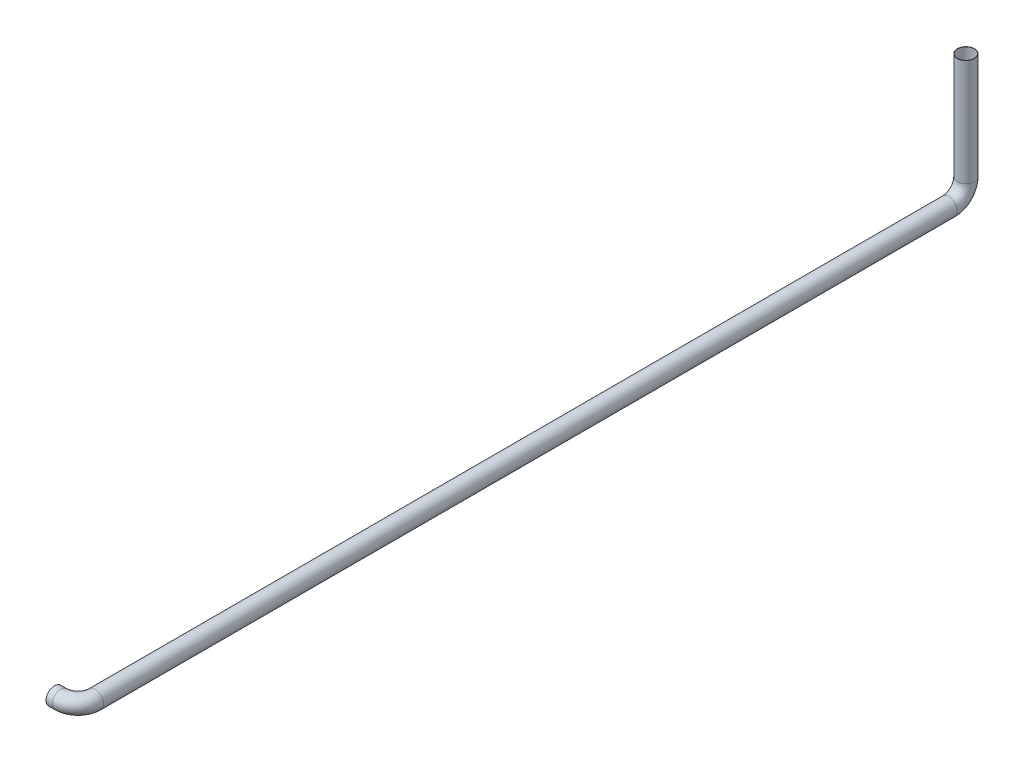
ISO-10303-21;
HEADER;
FILE_DESCRIPTION(('STEP AP214'),'2;1');
FILE_NAME('part.step','',(''),(''),'','','');
FILE_SCHEMA(('AUTOMOTIVE_DESIGN { 1 0 10303 214 1 1 1 1 }'));
ENDSEC;
DATA;
#1=APPLICATION_CONTEXT('core data for automotive mechanical design processes');
#2=APPLICATION_PROTOCOL_DEFINITION('international standard','automotive_design',2000,#1);
#3=PRODUCT_CONTEXT('',#1,'mechanical');
#4=PRODUCT('Part','Part','',(#3));
#5=PRODUCT_RELATED_PRODUCT_CATEGORY('part','',(#4));
#6=PRODUCT_DEFINITION_FORMATION('','',#4);
#7=PRODUCT_DEFINITION_CONTEXT('part definition',#1,'design');
#8=PRODUCT_DEFINITION('design','',#6,#7);
#9=PRODUCT_DEFINITION_SHAPE('','',#8);
#10=(LENGTH_UNIT() NAMED_UNIT(*) SI_UNIT(.MILLI.,.METRE.));
#11=(NAMED_UNIT(*) PLANE_ANGLE_UNIT() SI_UNIT($,.RADIAN.));
#12=(NAMED_UNIT(*) SI_UNIT($,.STERADIAN.) SOLID_ANGLE_UNIT());
#13=UNCERTAINTY_MEASURE_WITH_UNIT(LENGTH_MEASURE(1.E-05),#10,'distance_accuracy_value','');
#14=(GEOMETRIC_REPRESENTATION_CONTEXT(3) GLOBAL_UNCERTAINTY_ASSIGNED_CONTEXT((#13)) GLOBAL_UNIT_ASSIGNED_CONTEXT((#10,
#11,#12)) REPRESENTATION_CONTEXT('',''));
#15=CARTESIAN_POINT('',(0.,0.,0.));
#16=DIRECTION('',(0.,0.,1.));
#17=DIRECTION('',(1.,0.,0.));
#18=AXIS2_PLACEMENT_3D('',#15,#16,#17);
#19=CARTESIAN_POINT('',(-28941.6176832913,-14739.1333534145,39013.8901960568));
#20=DIRECTION('',(0.,1.,0.));
#21=DIRECTION('',(-1.,0.,0.));
#22=AXIS2_PLACEMENT_3D('',#19,#20,#21);
#23=PLANE('',#22);
#24=CARTESIAN_POINT('',(-28941.6176832913,-14739.1333534145,39013.8901960568));
#25=DIRECTION('',(0.,1.,0.));
#26=DIRECTION('',(0.,0.,1.));
#27=AXIS2_PLACEMENT_3D('',#24,#25,#26);
#28=CIRCLE('',#27,29.0000000000011);
#29=CARTESIAN_POINT('',(-28941.6176832913,-14739.1333534145,39042.8901960568));
#30=VERTEX_POINT('',#29);
#31=EDGE_CURVE('E76',#30,#30,#28,.T.);
#32=ORIENTED_EDGE('',*,*,#31,.F.);
#33=EDGE_LOOP('',(#32));
#34=FACE_BOUND('',#33,.T.);
#35=CARTESIAN_POINT('',(-28941.6176832913,-14739.1333534145,39013.8901960568));
#36=DIRECTION('',(0.,1.,0.));
#37=DIRECTION('',(-1.,0.,0.));
#38=AXIS2_PLACEMENT_3D('',#35,#36,#37);
#39=CIRCLE('',#38,30.0000000000011);
#40=CARTESIAN_POINT('',(-28971.6176832913,-14739.1333534145,39013.8901960568));
#41=VERTEX_POINT('',#40);
#42=EDGE_CURVE('E69',#41,#41,#39,.T.);
#43=ORIENTED_EDGE('',*,*,#42,.T.);
#44=EDGE_LOOP('',(#43));
#45=FACE_BOUND('',#44,.T.);
#46=ADVANCED_FACE('F47',(#34,#45),#23,.T.);
#47=CARTESIAN_POINT('',(-29023.421998341,-15172.0136339345,42121.7001960568));
#48=DIRECTION('',(1.,0.,0.));
#49=DIRECTION('',(0.,0.,-1.));
#50=AXIS2_PLACEMENT_3D('',#47,#48,#49);
#51=PLANE('',#50);
#52=CARTESIAN_POINT('',(-29023.421998341,-15172.0136339345,42121.7001960568));
#53=DIRECTION('',(1.,0.,0.));
#54=DIRECTION('',(0.,0.,-1.));
#55=AXIS2_PLACEMENT_3D('',#52,#53,#54);
#56=CIRCLE('',#55,29.0000000000011);
#57=CARTESIAN_POINT('',(-29023.421998341,-15172.0136339345,42092.7001960568));
#58=VERTEX_POINT('',#57);
#59=EDGE_CURVE('E72',#58,#58,#56,.T.);
#60=ORIENTED_EDGE('',*,*,#59,.T.);
#61=EDGE_LOOP('',(#60));
#62=FACE_BOUND('',#61,.T.);
#63=CARTESIAN_POINT('',(-29023.421998341,-15172.0136339345,42121.7001960568));
#64=DIRECTION('',(1.,0.,0.));
#65=DIRECTION('',(0.,0.,-1.));
#66=AXIS2_PLACEMENT_3D('',#63,#64,#65);
#67=CIRCLE('',#66,30.0000000000011);
#68=CARTESIAN_POINT('',(-29023.421998341,-15172.0136339345,42091.7001960568));
#69=VERTEX_POINT('',#68);
#70=EDGE_CURVE('E11',#69,#69,#67,.T.);
#71=ORIENTED_EDGE('',*,*,#70,.F.);
#72=EDGE_LOOP('',(#71));
#73=FACE_BOUND('',#72,.T.);
#74=ADVANCED_FACE('F102',(#62,#73),#51,.F.);
#75=CARTESIAN_POINT('',(-28941.6176832913,-14739.1333534145,39013.8901960568));
#76=DIRECTION('',(0.,-1.,0.));
#77=DIRECTION('',(0.,0.,-1.));
#78=AXIS2_PLACEMENT_3D('',#75,#76,#77);
#79=CYLINDRICAL_SURFACE('',#78,30.0000000000011);
#80=CARTESIAN_POINT('',(-28941.6176832913,-15112.0136339345,39013.8901960568));
#81=DIRECTION('',(0.,1.,0.));
#82=DIRECTION('',(-1.,0.,0.));
#83=AXIS2_PLACEMENT_3D('',#80,#81,#82);
#84=CIRCLE('',#83,30.0000000000011);
#85=CARTESIAN_POINT('',(-28941.6176832913,-15112.0136339345,38983.8901960568));
#86=VERTEX_POINT('',#85);
#87=EDGE_CURVE('E66',#86,#86,#84,.T.);
#88=ORIENTED_EDGE('',*,*,#87,.T.);
#89=EDGE_LOOP('',(#88));
#90=FACE_BOUND('',#89,.T.);
#91=ORIENTED_EDGE('',*,*,#42,.F.);
#92=EDGE_LOOP('',(#91));
#93=FACE_BOUND('',#92,.T.);
#94=ADVANCED_FACE('F106',(#90,#93),#79,.T.);
#95=CARTESIAN_POINT('',(-28941.6176832913,-15112.0136339345,39073.8901960568));
#96=DIRECTION('',(-1.,0.,0.));
#97=DIRECTION('',(0.,0.,1.));
#98=AXIS2_PLACEMENT_3D('',#95,#96,#97);
#99=TOROIDAL_SURFACE('',#98,59.9999999999881,30.0000000000011);
#100=CARTESIAN_POINT('',(-28941.6176832913,-15172.0136339345,39073.8901960568));
#101=DIRECTION('',(0.,0.,-1.));
#102=DIRECTION('',(-1.,0.,0.));
#103=AXIS2_PLACEMENT_3D('',#100,#101,#102);
#104=CIRCLE('',#103,30.0000000000011);
#105=CARTESIAN_POINT('',(-28941.6176832913,-15202.0136339345,39073.8901960568));
#106=VERTEX_POINT('',#105);
#107=EDGE_CURVE('E61',#106,#106,#104,.T.);
#108=CARTESIAN_POINT('',(-28941.6176832913,-15112.0136339345,39073.8901960568));
#109=DIRECTION('',(-1.,0.,0.));
#110=DIRECTION('',(0.,0.,1.));
#111=AXIS2_PLACEMENT_3D('',#108,#109,#110);
#112=CIRCLE('',#111,89.9999999999892);
#113=EDGE_CURVE('',#86,#106,#112,.T.);
#114=ORIENTED_EDGE('',*,*,#87,.F.);
#115=ORIENTED_EDGE('',*,*,#107,.T.);
#116=ORIENTED_EDGE('',*,*,#113,.T.);
#117=ORIENTED_EDGE('',*,*,#113,.F.);
#118=EDGE_LOOP('',(#114,#116,#115,#117));
#119=FACE_BOUND('',#118,.T.);
#120=ADVANCED_FACE('F108',(#119),#99,.T.);
#121=CARTESIAN_POINT('',(-28941.6176832913,-15172.0136339345,39073.8901960568));
#122=DIRECTION('',(0.,0.,1.));
#123=DIRECTION('',(0.,-1.,0.));
#124=AXIS2_PLACEMENT_3D('',#121,#122,#123);
#125=CYLINDRICAL_SURFACE('',#124,30.0000000000011);
#126=CARTESIAN_POINT('',(-28941.6176832913,-15172.0136339345,42061.7001960568));
#127=DIRECTION('',(0.,0.,-1.));
#128=DIRECTION('',(-1.,0.,0.));
#129=AXIS2_PLACEMENT_3D('',#126,#127,#128);
#130=CIRCLE('',#129,30.0000000000011);
#131=CARTESIAN_POINT('',(-28911.6176832913,-15172.0136339345,42061.7001960568));
#132=VERTEX_POINT('',#131);
#133=EDGE_CURVE('E57',#132,#132,#130,.T.);
#134=ORIENTED_EDGE('',*,*,#133,.T.);
#135=EDGE_LOOP('',(#134));
#136=FACE_BOUND('',#135,.T.);
#137=ORIENTED_EDGE('',*,*,#107,.F.);
#138=EDGE_LOOP('',(#137));
#139=FACE_BOUND('',#138,.T.);
#140=ADVANCED_FACE('F115',(#136,#139),#125,.T.);
#141=CARTESIAN_POINT('',(-29001.6176832913,-15172.0136339345,42061.7001960568));
#142=DIRECTION('',(0.,-1.,0.));
#143=DIRECTION('',(0.,0.,-1.));
#144=AXIS2_PLACEMENT_3D('',#141,#142,#143);
#145=TOROIDAL_SURFACE('',#144,59.9999999999916,30.0000000000011);
#146=CARTESIAN_POINT('',(-29001.6176832913,-15172.0136339345,42121.7001960568));
#147=DIRECTION('',(1.,0.,0.));
#148=DIRECTION('',(0.,0.,-1.));
#149=AXIS2_PLACEMENT_3D('',#146,#147,#148);
#150=CIRCLE('',#149,30.0000000000011);
#151=CARTESIAN_POINT('',(-29001.6176832913,-15172.0136339345,42151.7001960568));
#152=VERTEX_POINT('',#151);
#153=EDGE_CURVE('E53',#152,#152,#150,.T.);
#154=CARTESIAN_POINT('',(-29001.6176832913,-15172.0136339345,42061.7001960568));
#155=DIRECTION('',(0.,-1.,0.));
#156=DIRECTION('',(0.,0.,-1.));
#157=AXIS2_PLACEMENT_3D('',#154,#155,#156);
#158=CIRCLE('',#157,89.9999999999928);
#159=EDGE_CURVE('',#132,#152,#158,.T.);
#160=ORIENTED_EDGE('',*,*,#133,.F.);
#161=ORIENTED_EDGE('',*,*,#153,.T.);
#162=ORIENTED_EDGE('',*,*,#159,.T.);
#163=ORIENTED_EDGE('',*,*,#159,.F.);
#164=EDGE_LOOP('',(#160,#162,#161,#163));
#165=FACE_BOUND('',#164,.T.);
#166=ADVANCED_FACE('F121',(#165),#145,.T.);
#167=CARTESIAN_POINT('',(-29001.6176832913,-15172.0136339345,42121.7001960568));
#168=DIRECTION('',(-1.,0.,0.));
#169=DIRECTION('',(0.,0.,1.));
#170=AXIS2_PLACEMENT_3D('',#167,#168,#169);
#171=CYLINDRICAL_SURFACE('',#170,30.0000000000011);
#172=ORIENTED_EDGE('',*,*,#70,.T.);
#173=EDGE_LOOP('',(#172));
#174=FACE_BOUND('',#173,.T.);
#175=ORIENTED_EDGE('',*,*,#153,.F.);
#176=EDGE_LOOP('',(#175));
#177=FACE_BOUND('',#176,.T.);
#178=ADVANCED_FACE('F96',(#174,#177),#171,.T.);
#179=CARTESIAN_POINT('',(-28941.6176832913,-14739.1333534145,39013.8901960568));
#180=DIRECTION('',(0.,-1.,0.));
#181=DIRECTION('',(0.,0.,-1.));
#182=AXIS2_PLACEMENT_3D('',#179,#180,#181);
#183=CYLINDRICAL_SURFACE('',#182,29.0000000000011);
#184=CARTESIAN_POINT('',(-28941.6176832913,-15112.0136339345,39013.8901960568));
#185=DIRECTION('',(0.,-1.,0.));
#186=DIRECTION('',(0.,0.,-1.));
#187=AXIS2_PLACEMENT_3D('',#184,#185,#186);
#188=CIRCLE('',#187,29.0000000000011);
#189=CARTESIAN_POINT('',(-28941.6176832913,-15112.0136339345,38984.8901960568));
#190=VERTEX_POINT('',#189);
#191=EDGE_CURVE('E79',#190,#190,#188,.F.);
#192=ORIENTED_EDGE('',*,*,#191,.F.);
#193=EDGE_LOOP('',(#192));
#194=FACE_BOUND('',#193,.T.);
#195=ORIENTED_EDGE('',*,*,#31,.T.);
#196=EDGE_LOOP('',(#195));
#197=FACE_BOUND('',#196,.T.);
#198=ADVANCED_FACE('F93',(#194,#197),#183,.F.);
#199=CARTESIAN_POINT('',(-28941.6176832913,-15112.0136339345,39073.8901960568));
#200=DIRECTION('',(-1.,0.,0.));
#201=DIRECTION('',(0.,0.,1.));
#202=AXIS2_PLACEMENT_3D('',#199,#200,#201);
#203=TOROIDAL_SURFACE('',#202,59.9999999999881,29.0000000000011);
#204=CARTESIAN_POINT('',(-28941.6176832913,-15172.0136339345,39073.8901960568));
#205=DIRECTION('',(0.,0.,-1.));
#206=DIRECTION('',(0.,1.,0.));
#207=AXIS2_PLACEMENT_3D('',#204,#205,#206);
#208=CIRCLE('',#207,29.0000000000011);
#209=CARTESIAN_POINT('',(-28941.6176832913,-15201.0136339345,39073.8901960568));
#210=VERTEX_POINT('',#209);
#211=EDGE_CURVE('E85',#210,#210,#208,.T.);
#212=CARTESIAN_POINT('',(-28941.6176832913,-15112.0136339345,39073.8901960568));
#213=DIRECTION('',(-1.,0.,0.));
#214=DIRECTION('',(0.,0.,1.));
#215=AXIS2_PLACEMENT_3D('',#212,#213,#214);
#216=CIRCLE('',#215,88.9999999999892);
#217=EDGE_CURVE('',#190,#210,#216,.T.);
#218=ORIENTED_EDGE('',*,*,#191,.T.);
#219=ORIENTED_EDGE('',*,*,#211,.F.);
#220=ORIENTED_EDGE('',*,*,#217,.T.);
#221=ORIENTED_EDGE('',*,*,#217,.F.);
#222=EDGE_LOOP('',(#218,#220,#219,#221));
#223=FACE_BOUND('',#222,.T.);
#224=ADVANCED_FACE('F91',(#223),#203,.F.);
#225=CARTESIAN_POINT('',(-28941.6176832913,-15172.0136339345,39073.8901960568));
#226=DIRECTION('',(0.,0.,1.));
#227=DIRECTION('',(0.,-1.,0.));
#228=AXIS2_PLACEMENT_3D('',#225,#226,#227);
#229=CYLINDRICAL_SURFACE('',#228,29.0000000000011);
#230=CARTESIAN_POINT('',(-28941.6176832913,-15172.0136339345,42061.7001960568));
#231=DIRECTION('',(0.,0.,1.));
#232=DIRECTION('',(0.,-1.,0.));
#233=AXIS2_PLACEMENT_3D('',#230,#231,#232);
#234=CIRCLE('',#233,29.0000000000011);
#235=CARTESIAN_POINT('',(-28912.6176832913,-15172.0136339345,42061.7001960568));
#236=VERTEX_POINT('',#235);
#237=EDGE_CURVE('E82',#236,#236,#234,.F.);
#238=ORIENTED_EDGE('',*,*,#237,.F.);
#239=EDGE_LOOP('',(#238));
#240=FACE_BOUND('',#239,.T.);
#241=ORIENTED_EDGE('',*,*,#211,.T.);
#242=EDGE_LOOP('',(#241));
#243=FACE_BOUND('',#242,.T.);
#244=ADVANCED_FACE('F167',(#240,#243),#229,.F.);
#245=CARTESIAN_POINT('',(-29001.6176832913,-15172.0136339345,42061.7001960568));
#246=DIRECTION('',(0.,-1.,0.));
#247=DIRECTION('',(0.,0.,-1.));
#248=AXIS2_PLACEMENT_3D('',#245,#246,#247);
#249=TOROIDAL_SURFACE('',#248,59.9999999999916,29.0000000000011);
#250=CARTESIAN_POINT('',(-29001.6176832913,-15172.0136339345,42121.7001960568));
#251=DIRECTION('',(1.,0.,0.));
#252=DIRECTION('',(0.,0.,-1.));
#253=AXIS2_PLACEMENT_3D('',#250,#251,#252);
#254=CIRCLE('',#253,29.0000000000011);
#255=CARTESIAN_POINT('',(-29001.6176832913,-15172.0136339345,42150.7001960568));
#256=VERTEX_POINT('',#255);
#257=EDGE_CURVE('E75',#256,#256,#254,.T.);
#258=CARTESIAN_POINT('',(-29001.6176832913,-15172.0136339345,42061.7001960568));
#259=DIRECTION('',(0.,-1.,0.));
#260=DIRECTION('',(0.,0.,-1.));
#261=AXIS2_PLACEMENT_3D('',#258,#259,#260);
#262=CIRCLE('',#261,88.9999999999928);
#263=EDGE_CURVE('',#236,#256,#262,.T.);
#264=ORIENTED_EDGE('',*,*,#237,.T.);
#265=ORIENTED_EDGE('',*,*,#257,.F.);
#266=ORIENTED_EDGE('',*,*,#263,.T.);
#267=ORIENTED_EDGE('',*,*,#263,.F.);
#268=EDGE_LOOP('',(#264,#266,#265,#267));
#269=FACE_BOUND('',#268,.T.);
#270=ADVANCED_FACE('F178',(#269),#249,.F.);
#271=CARTESIAN_POINT('',(-29001.6176832913,-15172.0136339345,42121.7001960568));
#272=DIRECTION('',(-1.,0.,0.));
#273=DIRECTION('',(0.,0.,1.));
#274=AXIS2_PLACEMENT_3D('',#271,#272,#273);
#275=CYLINDRICAL_SURFACE('',#274,29.0000000000011);
#276=ORIENTED_EDGE('',*,*,#59,.F.);
#277=EDGE_LOOP('',(#276));
#278=FACE_BOUND('',#277,.T.);
#279=ORIENTED_EDGE('',*,*,#257,.T.);
#280=EDGE_LOOP('',(#279));
#281=FACE_BOUND('',#280,.T.);
#282=ADVANCED_FACE('F103',(#278,#281),#275,.F.);
#283=CLOSED_SHELL('',(#46,#74,#94,#120,#140,#166,#178,#198,#224,#244,#270,#282));
#284=MANIFOLD_SOLID_BREP('B2',#283);
#285=ADVANCED_BREP_SHAPE_REPRESENTATION('',(#18,#284),#14);
#286=SHAPE_DEFINITION_REPRESENTATION(#9,#285);
ENDSEC;
END-ISO-10303-21;
